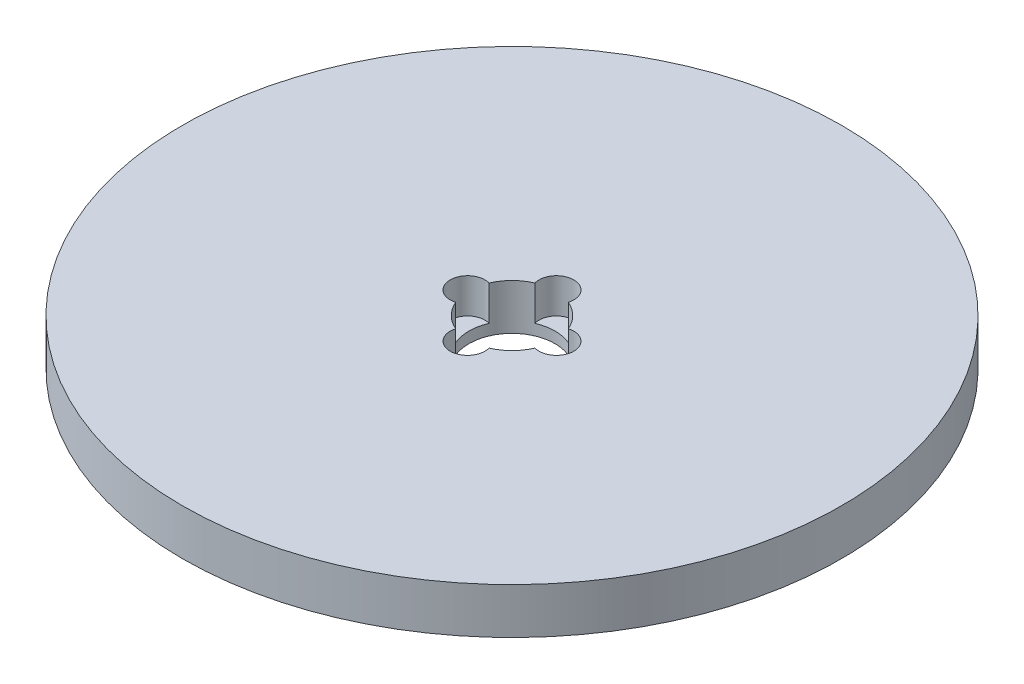
ISO-10303-21;
HEADER;
FILE_DESCRIPTION(('STEP AP214'),'2;1');
FILE_NAME('part.step','',(''),(''),'','','');
FILE_SCHEMA(('AUTOMOTIVE_DESIGN { 1 0 10303 214 1 1 1 1 }'));
ENDSEC;
DATA;
#1=APPLICATION_CONTEXT('core data for automotive mechanical design processes');
#2=APPLICATION_PROTOCOL_DEFINITION('international standard','automotive_design',2000,#1);
#3=PRODUCT_CONTEXT('',#1,'mechanical');
#4=PRODUCT('Part','Part','',(#3));
#5=PRODUCT_RELATED_PRODUCT_CATEGORY('part','',(#4));
#6=PRODUCT_DEFINITION_FORMATION('','',#4);
#7=PRODUCT_DEFINITION_CONTEXT('part definition',#1,'design');
#8=PRODUCT_DEFINITION('design','',#6,#7);
#9=PRODUCT_DEFINITION_SHAPE('','',#8);
#10=(LENGTH_UNIT() NAMED_UNIT(*) SI_UNIT(.MILLI.,.METRE.));
#11=(NAMED_UNIT(*) PLANE_ANGLE_UNIT() SI_UNIT($,.RADIAN.));
#12=(NAMED_UNIT(*) SI_UNIT($,.STERADIAN.) SOLID_ANGLE_UNIT());
#13=UNCERTAINTY_MEASURE_WITH_UNIT(LENGTH_MEASURE(1.E-05),#10,'distance_accuracy_value','');
#14=(GEOMETRIC_REPRESENTATION_CONTEXT(3) GLOBAL_UNCERTAINTY_ASSIGNED_CONTEXT((#13)) GLOBAL_UNIT_ASSIGNED_CONTEXT((#10,
#11,#12)) REPRESENTATION_CONTEXT('',''));
#15=CARTESIAN_POINT('',(0.,0.,0.));
#16=DIRECTION('',(0.,0.,1.));
#17=DIRECTION('',(1.,0.,0.));
#18=AXIS2_PLACEMENT_3D('',#15,#16,#17);
#19=CARTESIAN_POINT('',(0.,8.,0.));
#20=DIRECTION('',(0.,-1.,0.));
#21=DIRECTION('',(0.,0.,-1.));
#22=AXIS2_PLACEMENT_3D('',#19,#20,#21);
#23=CYLINDRICAL_SURFACE('',#22,57.5);
#24=CARTESIAN_POINT('',(0.,8.,0.));
#25=DIRECTION('',(0.,1.,0.));
#26=DIRECTION('',(0.,0.,1.));
#27=AXIS2_PLACEMENT_3D('',#24,#25,#26);
#28=CIRCLE('',#27,57.5);
#29=CARTESIAN_POINT('',(0.,8.,57.5));
#30=VERTEX_POINT('',#29);
#31=EDGE_CURVE('E145',#30,#30,#28,.T.);
#32=ORIENTED_EDGE('',*,*,#31,.F.);
#33=EDGE_LOOP('',(#32));
#34=FACE_BOUND('',#33,.T.);
#35=CARTESIAN_POINT('',(0.,0.,0.));
#36=DIRECTION('',(0.,1.,0.));
#37=DIRECTION('',(0.,0.,1.));
#38=AXIS2_PLACEMENT_3D('',#35,#36,#37);
#39=CIRCLE('',#38,57.5);
#40=CARTESIAN_POINT('',(0.,0.,57.5));
#41=VERTEX_POINT('',#40);
#42=EDGE_CURVE('E143',#41,#41,#39,.T.);
#43=ORIENTED_EDGE('',*,*,#42,.T.);
#44=EDGE_LOOP('',(#43));
#45=FACE_BOUND('',#44,.T.);
#46=ADVANCED_FACE('F39',(#34,#45),#23,.T.);
#47=CARTESIAN_POINT('',(0.,8.,0.));
#48=DIRECTION('',(0.,1.,0.));
#49=DIRECTION('',(0.,0.,1.));
#50=AXIS2_PLACEMENT_3D('',#47,#48,#49);
#51=PLANE('',#50);
#52=CARTESIAN_POINT('',(0.,8.,7.75111891946528));
#53=DIRECTION('',(0.,1.,0.));
#54=DIRECTION('',(1.,0.,0.));
#55=AXIS2_PLACEMENT_3D('',#52,#53,#54);
#56=CIRCLE('',#55,3.03341428644772);
#57=CARTESIAN_POINT('',(-2.91461233578034,8.,6.91050178584139));
#58=VERTEX_POINT('',#57);
#59=CARTESIAN_POINT('',(2.91461233578039,8.,6.91050178584137));
#60=VERTEX_POINT('',#59);
#61=EDGE_CURVE('E152',#58,#60,#56,.T.);
#62=ORIENTED_EDGE('',*,*,#61,.F.);
#63=CARTESIAN_POINT('',(0.,8.,0.));
#64=DIRECTION('',(0.,1.,0.));
#65=DIRECTION('',(0.,0.,1.));
#66=AXIS2_PLACEMENT_3D('',#63,#64,#65);
#67=CIRCLE('',#66,7.5);
#68=CARTESIAN_POINT('',(-6.91050178584138,8.,2.91461233578037));
#69=VERTEX_POINT('',#68);
#70=EDGE_CURVE('E133',#69,#58,#67,.T.);
#71=ORIENTED_EDGE('',*,*,#70,.F.);
#72=CARTESIAN_POINT('',(-7.75111891946528,8.,0.));
#73=DIRECTION('',(0.,1.,0.));
#74=DIRECTION('',(0.,0.,1.));
#75=AXIS2_PLACEMENT_3D('',#72,#73,#74);
#76=CIRCLE('',#75,3.03341428644772);
#77=CARTESIAN_POINT('',(-6.91050178584138,8.,-2.91461233578037));
#78=VERTEX_POINT('',#77);
#79=EDGE_CURVE('E128',#78,#69,#76,.T.);
#80=ORIENTED_EDGE('',*,*,#79,.F.);
#81=CARTESIAN_POINT('',(-2.91461233578044,8.,-6.91050178584135));
#82=VERTEX_POINT('',#81);
#83=EDGE_CURVE('E121',#82,#78,#67,.T.);
#84=ORIENTED_EDGE('',*,*,#83,.F.);
#85=CARTESIAN_POINT('',(0.,8.,-7.75111891946528));
#86=DIRECTION('',(0.,1.,0.));
#87=DIRECTION('',(-1.,0.,0.));
#88=AXIS2_PLACEMENT_3D('',#85,#86,#87);
#89=CIRCLE('',#88,3.03341428644772);
#90=CARTESIAN_POINT('',(2.9146123357803,8.,-6.91050178584141));
#91=VERTEX_POINT('',#90);
#92=EDGE_CURVE('E105',#91,#82,#89,.T.);
#93=ORIENTED_EDGE('',*,*,#92,.F.);
#94=CARTESIAN_POINT('',(6.91050178584138,8.,-2.91461233578037));
#95=VERTEX_POINT('',#94);
#96=EDGE_CURVE('E131',#95,#91,#67,.T.);
#97=ORIENTED_EDGE('',*,*,#96,.F.);
#98=CARTESIAN_POINT('',(7.75111891946528,8.,0.));
#99=DIRECTION('',(0.,1.,0.));
#100=DIRECTION('',(0.,0.,-1.));
#101=AXIS2_PLACEMENT_3D('',#98,#99,#100);
#102=CIRCLE('',#101,3.03341428644772);
#103=CARTESIAN_POINT('',(6.91050178584138,8.,2.91461233578037));
#104=VERTEX_POINT('',#103);
#105=EDGE_CURVE('E154',#104,#95,#102,.T.);
#106=ORIENTED_EDGE('',*,*,#105,.F.);
#107=EDGE_CURVE('E134',#60,#104,#67,.T.);
#108=ORIENTED_EDGE('',*,*,#107,.F.);
#109=EDGE_LOOP('',(#62,#71,#80,#84,#93,#97,#106,#108));
#110=FACE_BOUND('',#109,.T.);
#111=ORIENTED_EDGE('',*,*,#31,.T.);
#112=EDGE_LOOP('',(#111));
#113=FACE_BOUND('',#112,.T.);
#114=ADVANCED_FACE('F130',(#110,#113),#51,.T.);
#115=CARTESIAN_POINT('',(0.,0.,0.));
#116=DIRECTION('',(0.,1.,0.));
#117=DIRECTION('',(0.,0.,1.));
#118=AXIS2_PLACEMENT_3D('',#115,#116,#117);
#119=PLANE('',#118);
#120=CARTESIAN_POINT('',(0.,0.,0.));
#121=DIRECTION('',(0.,1.,0.));
#122=DIRECTION('',(0.,0.,1.));
#123=AXIS2_PLACEMENT_3D('',#120,#121,#122);
#124=CIRCLE('',#123,7.5);
#125=CARTESIAN_POINT('',(0.,0.,7.5));
#126=VERTEX_POINT('',#125);
#127=EDGE_CURVE('E135',#126,#126,#124,.T.);
#128=ORIENTED_EDGE('',*,*,#127,.T.);
#129=EDGE_LOOP('',(#128));
#130=FACE_BOUND('',#129,.T.);
#131=ORIENTED_EDGE('',*,*,#42,.F.);
#132=EDGE_LOOP('',(#131));
#133=FACE_BOUND('',#132,.T.);
#134=ADVANCED_FACE('F195',(#130,#133),#119,.F.);
#135=CARTESIAN_POINT('',(0.,8.,0.));
#136=DIRECTION('',(0.,-1.,0.));
#137=DIRECTION('',(0.,0.,-1.));
#138=AXIS2_PLACEMENT_3D('',#135,#136,#137);
#139=CYLINDRICAL_SURFACE('',#138,7.5);
#140=DIRECTION('',(0.,1.,0.));
#141=VECTOR('',#140,1.);
#142=CARTESIAN_POINT('',(-2.91461233578034,4.95646122645667,6.91050178584139));
#143=LINE('',#142,#141);
#144=CARTESIAN_POINT('',(-2.91461233578034,1.91292245291335,6.91050178584139));
#145=VERTEX_POINT('',#144);
#146=EDGE_CURVE('E11',#145,#58,#143,.T.);
#147=ORIENTED_EDGE('',*,*,#146,.F.);
#148=CARTESIAN_POINT('',(0.,1.91292245291335,0.));
#149=DIRECTION('',(0.,1.,0.));
#150=DIRECTION('',(0.,0.,1.));
#151=AXIS2_PLACEMENT_3D('',#148,#149,#150);
#152=CIRCLE('',#151,7.5);
#153=CARTESIAN_POINT('',(2.91461233578039,1.91292245291335,6.91050178584137));
#154=VERTEX_POINT('',#153);
#155=EDGE_CURVE('E169',#145,#154,#152,.T.);
#156=ORIENTED_EDGE('',*,*,#155,.T.);
#157=DIRECTION('',(0.,1.,0.));
#158=VECTOR('',#157,1.);
#159=CARTESIAN_POINT('',(2.91461233578039,4.95646122645667,6.91050178584137));
#160=LINE('',#159,#158);
#161=EDGE_CURVE('E46',#60,#154,#160,.F.);
#162=ORIENTED_EDGE('',*,*,#161,.F.);
#163=ORIENTED_EDGE('',*,*,#107,.T.);
#164=DIRECTION('',(0.,1.,0.));
#165=VECTOR('',#164,1.);
#166=CARTESIAN_POINT('',(6.91050178584138,4.95646122645667,2.91461233578037));
#167=LINE('',#166,#165);
#168=CARTESIAN_POINT('',(6.91050178584138,1.91292245291335,2.91461233578037));
#169=VERTEX_POINT('',#168);
#170=EDGE_CURVE('E151',#169,#104,#167,.T.);
#171=ORIENTED_EDGE('',*,*,#170,.F.);
#172=CARTESIAN_POINT('',(0.,1.91292245291335,0.));
#173=DIRECTION('',(0.,1.,0.));
#174=DIRECTION('',(0.,0.,1.));
#175=AXIS2_PLACEMENT_3D('',#172,#173,#174);
#176=CIRCLE('',#175,7.5);
#177=CARTESIAN_POINT('',(6.91050178584138,1.91292245291335,-2.91461233578037));
#178=VERTEX_POINT('',#177);
#179=EDGE_CURVE('E173',#169,#178,#176,.T.);
#180=ORIENTED_EDGE('',*,*,#179,.T.);
#181=DIRECTION('',(0.,1.,0.));
#182=VECTOR('',#181,1.);
#183=CARTESIAN_POINT('',(6.91050178584138,4.95646122645667,-2.91461233578037));
#184=LINE('',#183,#182);
#185=EDGE_CURVE('E168',#95,#178,#184,.F.);
#186=ORIENTED_EDGE('',*,*,#185,.F.);
#187=ORIENTED_EDGE('',*,*,#96,.T.);
#188=DIRECTION('',(0.,1.,0.));
#189=VECTOR('',#188,1.);
#190=CARTESIAN_POINT('',(2.9146123357803,4.95646122645667,-6.91050178584141));
#191=LINE('',#190,#189);
#192=CARTESIAN_POINT('',(2.9146123357803,1.91292245291335,-6.91050178584141));
#193=VERTEX_POINT('',#192);
#194=EDGE_CURVE('E108',#193,#91,#191,.T.);
#195=ORIENTED_EDGE('',*,*,#194,.F.);
#196=CARTESIAN_POINT('',(0.,1.91292245291335,0.));
#197=DIRECTION('',(0.,1.,0.));
#198=DIRECTION('',(0.,0.,1.));
#199=AXIS2_PLACEMENT_3D('',#196,#197,#198);
#200=CIRCLE('',#199,7.5);
#201=CARTESIAN_POINT('',(-2.91461233578044,1.91292245291335,-6.91050178584135));
#202=VERTEX_POINT('',#201);
#203=EDGE_CURVE('E122',#193,#202,#200,.T.);
#204=ORIENTED_EDGE('',*,*,#203,.T.);
#205=DIRECTION('',(0.,1.,0.));
#206=VECTOR('',#205,1.);
#207=CARTESIAN_POINT('',(-2.91461233578044,4.95646122645667,-6.91050178584135));
#208=LINE('',#207,#206);
#209=EDGE_CURVE('E106',#82,#202,#208,.F.);
#210=ORIENTED_EDGE('',*,*,#209,.F.);
#211=ORIENTED_EDGE('',*,*,#83,.T.);
#212=DIRECTION('',(0.,1.,0.));
#213=VECTOR('',#212,1.);
#214=CARTESIAN_POINT('',(-6.91050178584138,4.95646122645667,-2.91461233578037));
#215=LINE('',#214,#213);
#216=CARTESIAN_POINT('',(-6.91050178584138,1.91292245291335,-2.91461233578037));
#217=VERTEX_POINT('',#216);
#218=EDGE_CURVE('E177',#217,#78,#215,.T.);
#219=ORIENTED_EDGE('',*,*,#218,.F.);
#220=CARTESIAN_POINT('',(0.,1.91292245291335,0.));
#221=DIRECTION('',(0.,1.,0.));
#222=DIRECTION('',(0.,0.,1.));
#223=AXIS2_PLACEMENT_3D('',#220,#221,#222);
#224=CIRCLE('',#223,7.5);
#225=CARTESIAN_POINT('',(-6.91050178584138,1.91292245291335,2.91461233578037));
#226=VERTEX_POINT('',#225);
#227=EDGE_CURVE('E185',#217,#226,#224,.T.);
#228=ORIENTED_EDGE('',*,*,#227,.T.);
#229=DIRECTION('',(0.,1.,0.));
#230=VECTOR('',#229,1.);
#231=CARTESIAN_POINT('',(-6.91050178584138,4.95646122645667,2.91461233578037));
#232=LINE('',#231,#230);
#233=EDGE_CURVE('E179',#69,#226,#232,.F.);
#234=ORIENTED_EDGE('',*,*,#233,.F.);
#235=ORIENTED_EDGE('',*,*,#70,.T.);
#236=EDGE_LOOP('',(#147,#156,#162,#163,#171,#180,#186,#187,#195,#204,#210,#211,#219,#228,#234,#235));
#237=FACE_BOUND('',#236,.T.);
#238=ORIENTED_EDGE('',*,*,#127,.F.);
#239=EDGE_LOOP('',(#238));
#240=FACE_BOUND('',#239,.T.);
#241=ADVANCED_FACE('F117',(#237,#240),#139,.F.);
#242=CARTESIAN_POINT('',(-7.75111891946528,1.91292245291335,0.));
#243=DIRECTION('',(0.,1.,0.));
#244=DIRECTION('',(0.,0.,1.));
#245=AXIS2_PLACEMENT_3D('',#242,#243,#244);
#246=CYLINDRICAL_SURFACE('',#245,3.03341428644772);
#247=ORIENTED_EDGE('',*,*,#218,.T.);
#248=ORIENTED_EDGE('',*,*,#79,.T.);
#249=ORIENTED_EDGE('',*,*,#233,.T.);
#250=CARTESIAN_POINT('',(-7.75111891946528,1.91292245291335,0.));
#251=DIRECTION('',(0.,1.,0.));
#252=DIRECTION('',(0.,0.,1.));
#253=AXIS2_PLACEMENT_3D('',#250,#251,#252);
#254=CIRCLE('',#253,3.03341428644772);
#255=EDGE_CURVE('E140',#217,#226,#254,.T.);
#256=ORIENTED_EDGE('',*,*,#255,.F.);
#257=EDGE_LOOP('',(#247,#248,#249,#256));
#258=FACE_BOUND('',#257,.T.);
#259=ADVANCED_FACE('F200',(#258),#246,.F.);
#260=CARTESIAN_POINT('',(-7.75111891946528,1.91292245291335,0.));
#261=DIRECTION('',(0.,1.,0.));
#262=DIRECTION('',(0.,0.,1.));
#263=AXIS2_PLACEMENT_3D('',#260,#261,#262);
#264=PLANE('',#263);
#265=ORIENTED_EDGE('',*,*,#255,.T.);
#266=ORIENTED_EDGE('',*,*,#227,.F.);
#267=EDGE_LOOP('',(#265,#266));
#268=FACE_BOUND('',#267,.T.);
#269=ADVANCED_FACE('F202',(#268),#264,.T.);
#270=CARTESIAN_POINT('',(0.,1.91292245291335,-7.75111891946528));
#271=DIRECTION('',(0.,1.,0.));
#272=DIRECTION('',(0.,0.,1.));
#273=AXIS2_PLACEMENT_3D('',#270,#271,#272);
#274=CYLINDRICAL_SURFACE('',#273,3.03341428644772);
#275=ORIENTED_EDGE('',*,*,#194,.T.);
#276=ORIENTED_EDGE('',*,*,#92,.T.);
#277=ORIENTED_EDGE('',*,*,#209,.T.);
#278=CARTESIAN_POINT('',(0.,1.91292245291335,-7.75111891946528));
#279=DIRECTION('',(0.,1.,0.));
#280=DIRECTION('',(-1.,0.,0.));
#281=AXIS2_PLACEMENT_3D('',#278,#279,#280);
#282=CIRCLE('',#281,3.03341428644772);
#283=EDGE_CURVE('E111',#193,#202,#282,.T.);
#284=ORIENTED_EDGE('',*,*,#283,.F.);
#285=EDGE_LOOP('',(#275,#276,#277,#284));
#286=FACE_BOUND('',#285,.T.);
#287=ADVANCED_FACE('F102',(#286),#274,.F.);
#288=CARTESIAN_POINT('',(0.,1.91292245291335,-7.75111891946528));
#289=DIRECTION('',(0.,1.,0.));
#290=DIRECTION('',(-1.,0.,0.));
#291=AXIS2_PLACEMENT_3D('',#288,#289,#290);
#292=PLANE('',#291);
#293=ORIENTED_EDGE('',*,*,#283,.T.);
#294=ORIENTED_EDGE('',*,*,#203,.F.);
#295=EDGE_LOOP('',(#293,#294));
#296=FACE_BOUND('',#295,.T.);
#297=ADVANCED_FACE('F211',(#296),#292,.T.);
#298=CARTESIAN_POINT('',(7.75111891946528,1.91292245291335,0.));
#299=DIRECTION('',(0.,1.,0.));
#300=DIRECTION('',(0.,0.,1.));
#301=AXIS2_PLACEMENT_3D('',#298,#299,#300);
#302=CYLINDRICAL_SURFACE('',#301,3.03341428644772);
#303=ORIENTED_EDGE('',*,*,#170,.T.);
#304=ORIENTED_EDGE('',*,*,#105,.T.);
#305=ORIENTED_EDGE('',*,*,#185,.T.);
#306=CARTESIAN_POINT('',(7.75111891946528,1.91292245291335,0.));
#307=DIRECTION('',(0.,1.,0.));
#308=DIRECTION('',(0.,0.,-1.));
#309=AXIS2_PLACEMENT_3D('',#306,#307,#308);
#310=CIRCLE('',#309,3.03341428644772);
#311=EDGE_CURVE('E56',#169,#178,#310,.T.);
#312=ORIENTED_EDGE('',*,*,#311,.F.);
#313=EDGE_LOOP('',(#303,#304,#305,#312));
#314=FACE_BOUND('',#313,.T.);
#315=ADVANCED_FACE('F212',(#314),#302,.F.);
#316=CARTESIAN_POINT('',(7.75111891946528,1.91292245291335,0.));
#317=DIRECTION('',(0.,1.,0.));
#318=DIRECTION('',(0.,0.,-1.));
#319=AXIS2_PLACEMENT_3D('',#316,#317,#318);
#320=PLANE('',#319);
#321=ORIENTED_EDGE('',*,*,#311,.T.);
#322=ORIENTED_EDGE('',*,*,#179,.F.);
#323=EDGE_LOOP('',(#321,#322));
#324=FACE_BOUND('',#323,.T.);
#325=ADVANCED_FACE('F217',(#324),#320,.T.);
#326=CARTESIAN_POINT('',(0.,1.91292245291335,7.75111891946528));
#327=DIRECTION('',(0.,1.,0.));
#328=DIRECTION('',(0.,0.,1.));
#329=AXIS2_PLACEMENT_3D('',#326,#327,#328);
#330=CYLINDRICAL_SURFACE('',#329,3.03341428644772);
#331=ORIENTED_EDGE('',*,*,#146,.T.);
#332=ORIENTED_EDGE('',*,*,#61,.T.);
#333=ORIENTED_EDGE('',*,*,#161,.T.);
#334=CARTESIAN_POINT('',(0.,1.91292245291335,7.75111891946528));
#335=DIRECTION('',(0.,1.,0.));
#336=DIRECTION('',(1.,0.,0.));
#337=AXIS2_PLACEMENT_3D('',#334,#335,#336);
#338=CIRCLE('',#337,3.03341428644772);
#339=EDGE_CURVE('E55',#145,#154,#338,.T.);
#340=ORIENTED_EDGE('',*,*,#339,.F.);
#341=EDGE_LOOP('',(#331,#332,#333,#340));
#342=FACE_BOUND('',#341,.T.);
#343=ADVANCED_FACE('F170',(#342),#330,.F.);
#344=CARTESIAN_POINT('',(0.,1.91292245291335,7.75111891946528));
#345=DIRECTION('',(0.,1.,0.));
#346=DIRECTION('',(1.,0.,0.));
#347=AXIS2_PLACEMENT_3D('',#344,#345,#346);
#348=PLANE('',#347);
#349=ORIENTED_EDGE('',*,*,#339,.T.);
#350=ORIENTED_EDGE('',*,*,#155,.F.);
#351=EDGE_LOOP('',(#349,#350));
#352=FACE_BOUND('',#351,.T.);
#353=ADVANCED_FACE('F224',(#352),#348,.T.);
#354=CLOSED_SHELL('',(#46,#114,#134,#241,#259,#269,#287,#297,#315,#325,#343,#353));
#355=MANIFOLD_SOLID_BREP('B2',#354);
#356=ADVANCED_BREP_SHAPE_REPRESENTATION('',(#18,#355),#14);
#357=SHAPE_DEFINITION_REPRESENTATION(#9,#356);
ENDSEC;
END-ISO-10303-21;
